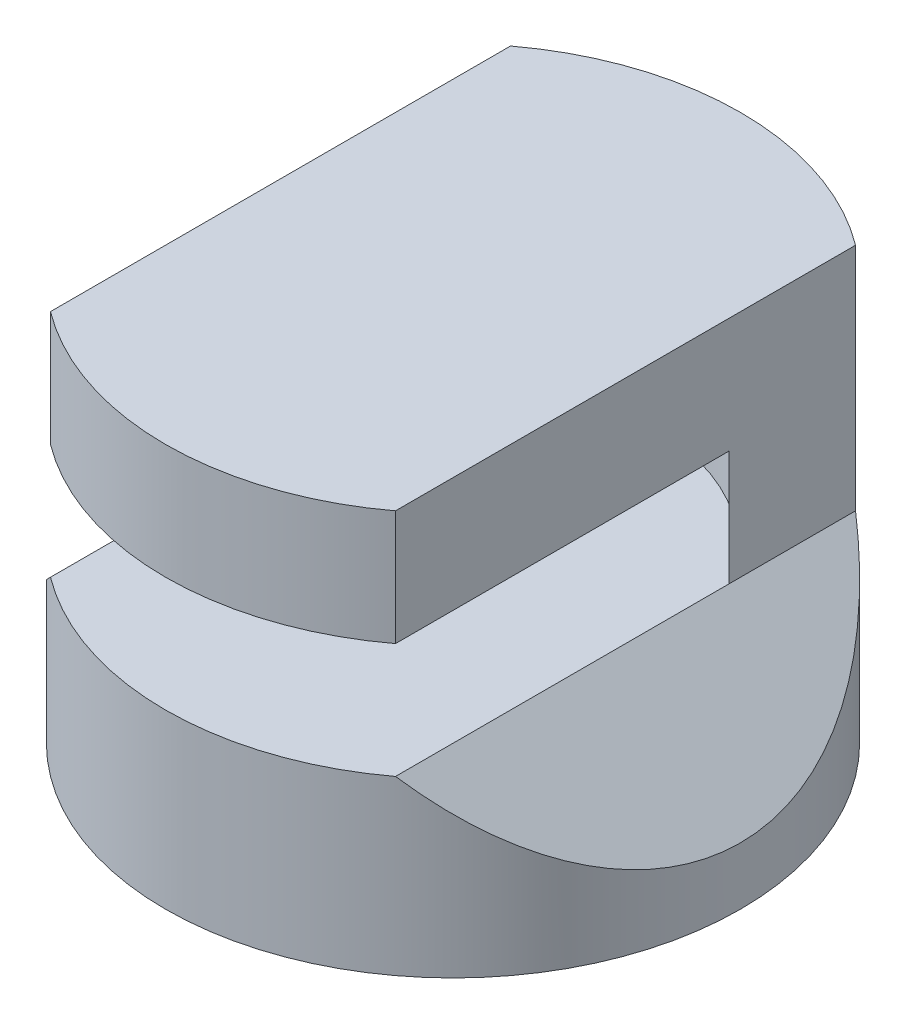
ISO-10303-21;
HEADER;
FILE_DESCRIPTION(('STEP AP214'),'2;1');
FILE_NAME('part.step','',(''),(''),'','','');
FILE_SCHEMA(('AUTOMOTIVE_DESIGN { 1 0 10303 214 1 1 1 1 }'));
ENDSEC;
DATA;
#1=APPLICATION_CONTEXT('core data for automotive mechanical design processes');
#2=APPLICATION_PROTOCOL_DEFINITION('international standard','automotive_design',2000,#1);
#3=PRODUCT_CONTEXT('',#1,'mechanical');
#4=PRODUCT('Part','Part','',(#3));
#5=PRODUCT_RELATED_PRODUCT_CATEGORY('part','',(#4));
#6=PRODUCT_DEFINITION_FORMATION('','',#4);
#7=PRODUCT_DEFINITION_CONTEXT('part definition',#1,'design');
#8=PRODUCT_DEFINITION('design','',#6,#7);
#9=PRODUCT_DEFINITION_SHAPE('','',#8);
#10=(LENGTH_UNIT() NAMED_UNIT(*) SI_UNIT(.MILLI.,.METRE.));
#11=(NAMED_UNIT(*) PLANE_ANGLE_UNIT() SI_UNIT($,.RADIAN.));
#12=(NAMED_UNIT(*) SI_UNIT($,.STERADIAN.) SOLID_ANGLE_UNIT());
#13=UNCERTAINTY_MEASURE_WITH_UNIT(LENGTH_MEASURE(1.E-05),#10,'distance_accuracy_value','');
#14=(GEOMETRIC_REPRESENTATION_CONTEXT(3) GLOBAL_UNCERTAINTY_ASSIGNED_CONTEXT((#13)) GLOBAL_UNIT_ASSIGNED_CONTEXT((#10,
#11,#12)) REPRESENTATION_CONTEXT('',''));
#15=CARTESIAN_POINT('',(0.,0.,0.));
#16=DIRECTION('',(0.,0.,1.));
#17=DIRECTION('',(1.,0.,0.));
#18=AXIS2_PLACEMENT_3D('',#15,#16,#17);
#19=CARTESIAN_POINT('',(20.,80.,100.));
#20=DIRECTION('',(-1.,0.,0.));
#21=DIRECTION('',(0.,-1.,0.));
#22=AXIS2_PLACEMENT_3D('',#19,#20,#21);
#23=PLANE('',#22);
#24=DIRECTION('',(0.,0.,-1.));
#25=VECTOR('',#24,1.);
#26=CARTESIAN_POINT('',(20.,60.,100.));
#27=LINE('',#26,#25);
#28=CARTESIAN_POINT('',(20.,60.,90.));
#29=VERTEX_POINT('',#28);
#30=CARTESIAN_POINT('',(20.,60.,31.97224362268));
#31=VERTEX_POINT('',#30);
#32=EDGE_CURVE('E215',#29,#31,#27,.T.);
#33=ORIENTED_EDGE('',*,*,#32,.F.);
#34=DIRECTION('',(0.,1.,0.));
#35=VECTOR('',#34,1.);
#36=CARTESIAN_POINT('',(20.,-20.,90.));
#37=LINE('',#36,#35);
#38=CARTESIAN_POINT('',(20.,80.,90.));
#39=VERTEX_POINT('',#38);
#40=EDGE_CURVE('E218',#29,#39,#37,.T.);
#41=ORIENTED_EDGE('',*,*,#40,.T.);
#42=DIRECTION('',(0.,0.,-1.));
#43=VECTOR('',#42,1.);
#44=CARTESIAN_POINT('',(20.,80.,100.));
#45=LINE('',#44,#43);
#46=CARTESIAN_POINT('',(20.,80.,9.99999999999999));
#47=VERTEX_POINT('',#46);
#48=EDGE_CURVE('E156',#39,#47,#45,.T.);
#49=ORIENTED_EDGE('',*,*,#48,.T.);
#50=DIRECTION('',(0.,1.,0.));
#51=VECTOR('',#50,1.);
#52=CARTESIAN_POINT('',(20.,-20.,9.99999999999999));
#53=LINE('',#52,#51);
#54=CARTESIAN_POINT('',(20.,40.,9.99999999999998));
#55=VERTEX_POINT('',#54);
#56=EDGE_CURVE('E274',#47,#55,#53,.F.);
#57=ORIENTED_EDGE('',*,*,#56,.T.);
#58=DIRECTION('',(0.,0.,-1.));
#59=VECTOR('',#58,1.);
#60=CARTESIAN_POINT('',(20.,40.,100.));
#61=LINE('',#60,#59);
#62=CARTESIAN_POINT('',(20.,40.,31.97224362268));
#63=VERTEX_POINT('',#62);
#64=EDGE_CURVE('E148',#63,#55,#61,.T.);
#65=ORIENTED_EDGE('',*,*,#64,.F.);
#66=DIRECTION('',(0.,1.,0.));
#67=VECTOR('',#66,1.);
#68=CARTESIAN_POINT('',(20.,40.,31.97224362268));
#69=LINE('',#68,#67);
#70=EDGE_CURVE('E221',#63,#31,#69,.T.);
#71=ORIENTED_EDGE('',*,*,#70,.T.);
#72=EDGE_LOOP('',(#33,#41,#49,#57,#65,#71));
#73=FACE_BOUND('',#72,.T.);
#74=ADVANCED_FACE('F133',(#73),#23,.T.);
#75=CARTESIAN_POINT('',(80.,80.,100.));
#76=DIRECTION('',(1.,0.,0.));
#77=DIRECTION('',(0.,0.,-1.));
#78=AXIS2_PLACEMENT_3D('',#75,#76,#77);
#79=PLANE('',#78);
#80=DIRECTION('',(0.,1.,0.));
#81=VECTOR('',#80,1.);
#82=CARTESIAN_POINT('',(80.,-20.,90.));
#83=LINE('',#82,#81);
#84=CARTESIAN_POINT('',(80.,80.,90.));
#85=VERTEX_POINT('',#84);
#86=CARTESIAN_POINT('',(80.,60.,90.));
#87=VERTEX_POINT('',#86);
#88=EDGE_CURVE('E238',#85,#87,#83,.F.);
#89=ORIENTED_EDGE('',*,*,#88,.T.);
#90=DIRECTION('',(0.,0.,1.));
#91=VECTOR('',#90,1.);
#92=CARTESIAN_POINT('',(80.,60.,100.));
#93=LINE('',#92,#91);
#94=CARTESIAN_POINT('',(80.,60.,31.9722436226801));
#95=VERTEX_POINT('',#94);
#96=EDGE_CURVE('E12',#95,#87,#93,.T.);
#97=ORIENTED_EDGE('',*,*,#96,.F.);
#98=DIRECTION('',(0.,1.,0.));
#99=VECTOR('',#98,1.);
#100=CARTESIAN_POINT('',(80.,40.,31.9722436226801));
#101=LINE('',#100,#99);
#102=CARTESIAN_POINT('',(80.,40.,31.9722436226801));
#103=VERTEX_POINT('',#102);
#104=EDGE_CURVE('E292',#103,#95,#101,.T.);
#105=ORIENTED_EDGE('',*,*,#104,.F.);
#106=DIRECTION('',(0.,0.,-1.));
#107=VECTOR('',#106,1.);
#108=CARTESIAN_POINT('',(80.,40.,100.));
#109=LINE('',#108,#107);
#110=CARTESIAN_POINT('',(80.,40.,10.));
#111=VERTEX_POINT('',#110);
#112=EDGE_CURVE('E256',#103,#111,#109,.T.);
#113=ORIENTED_EDGE('',*,*,#112,.T.);
#114=DIRECTION('',(0.,1.,0.));
#115=VECTOR('',#114,1.);
#116=CARTESIAN_POINT('',(80.,-20.,10.));
#117=LINE('',#116,#115);
#118=CARTESIAN_POINT('',(80.,80.,10.));
#119=VERTEX_POINT('',#118);
#120=EDGE_CURVE('E243',#111,#119,#117,.T.);
#121=ORIENTED_EDGE('',*,*,#120,.T.);
#122=DIRECTION('',(0.,0.,-1.));
#123=VECTOR('',#122,1.);
#124=CARTESIAN_POINT('',(80.,80.,100.));
#125=LINE('',#124,#123);
#126=EDGE_CURVE('E254',#85,#119,#125,.T.);
#127=ORIENTED_EDGE('',*,*,#126,.F.);
#128=EDGE_LOOP('',(#89,#97,#105,#113,#121,#127));
#129=FACE_BOUND('',#128,.T.);
#130=ADVANCED_FACE('F289',(#129),#79,.T.);
#131=CARTESIAN_POINT('',(50.,-20.,50.));
#132=DIRECTION('',(0.,1.,0.));
#133=DIRECTION('',(0.,0.,1.));
#134=AXIS2_PLACEMENT_3D('',#131,#132,#133);
#135=CYLINDRICAL_SURFACE('',#134,50.);
#136=CARTESIAN_POINT('',(50.,10.,50.));
#137=DIRECTION('',(0.,-1.,0.));
#138=DIRECTION('',(0.,0.,-1.));
#139=AXIS2_PLACEMENT_3D('',#136,#137,#138);
#140=CIRCLE('',#139,50.);
#141=CARTESIAN_POINT('',(50.,10.,0.));
#142=VERTEX_POINT('',#141);
#143=EDGE_CURVE('E251',#142,#142,#140,.T.);
#144=ORIENTED_EDGE('',*,*,#143,.F.);
#145=EDGE_LOOP('',(#144));
#146=FACE_BOUND('',#145,.T.);
#147=CARTESIAN_POINT('',(50.,70.,50.));
#148=DIRECTION('',(0.707106781186547,0.707106781186548,0.));
#149=DIRECTION('',(-0.707106781186548,0.707106781186547,0.));
#150=AXIS2_PLACEMENT_3D('',#147,#148,#149);
#151=ELLIPSE('',#150,70.7106781186547,50.);
#152=CARTESIAN_POINT('',(80.,40.,90.));
#153=VERTEX_POINT('',#152);
#154=EDGE_CURVE('E141',#153,#111,#151,.T.);
#155=ORIENTED_EDGE('',*,*,#154,.F.);
#156=CARTESIAN_POINT('',(50.,40.,50.));
#157=DIRECTION('',(0.,1.,0.));
#158=DIRECTION('',(0.,0.,1.));
#159=AXIS2_PLACEMENT_3D('',#156,#157,#158);
#160=CIRCLE('',#159,50.);
#161=CARTESIAN_POINT('',(20.,40.,90.));
#162=VERTEX_POINT('',#161);
#163=EDGE_CURVE('E232',#153,#162,#160,.F.);
#164=ORIENTED_EDGE('',*,*,#163,.T.);
#165=CARTESIAN_POINT('',(50.,70.,50.));
#166=DIRECTION('',(-0.707106781186547,0.707106781186548,0.));
#167=DIRECTION('',(0.707106781186548,0.707106781186547,0.));
#168=AXIS2_PLACEMENT_3D('',#165,#166,#167);
#169=ELLIPSE('',#168,70.7106781186547,50.);
#170=EDGE_CURVE('E249',#55,#162,#169,.T.);
#171=ORIENTED_EDGE('',*,*,#170,.F.);
#172=ORIENTED_EDGE('',*,*,#56,.F.);
#173=CARTESIAN_POINT('',(50.,80.,50.));
#174=DIRECTION('',(0.,1.,0.));
#175=DIRECTION('',(0.,0.,1.));
#176=AXIS2_PLACEMENT_3D('',#173,#174,#175);
#177=CIRCLE('',#176,50.);
#178=EDGE_CURVE('E246',#119,#47,#177,.T.);
#179=ORIENTED_EDGE('',*,*,#178,.F.);
#180=ORIENTED_EDGE('',*,*,#120,.F.);
#181=EDGE_LOOP('',(#155,#164,#171,#172,#179,#180));
#182=FACE_BOUND('',#181,.T.);
#183=ADVANCED_FACE('F285',(#146,#182),#135,.T.);
#184=ORIENTED_EDGE('',*,*,#40,.F.);
#185=CARTESIAN_POINT('',(50.,60.,50.));
#186=DIRECTION('',(0.,-1.,0.));
#187=DIRECTION('',(0.,0.,-1.));
#188=AXIS2_PLACEMENT_3D('',#185,#186,#187);
#189=CIRCLE('',#188,50.);
#190=EDGE_CURVE('E227',#29,#87,#189,.F.);
#191=ORIENTED_EDGE('',*,*,#190,.T.);
#192=ORIENTED_EDGE('',*,*,#88,.F.);
#193=CARTESIAN_POINT('',(50.,80.,50.));
#194=DIRECTION('',(0.,1.,0.));
#195=DIRECTION('',(0.,0.,1.));
#196=AXIS2_PLACEMENT_3D('',#193,#194,#195);
#197=CIRCLE('',#196,50.);
#198=EDGE_CURVE('E236',#39,#85,#197,.T.);
#199=ORIENTED_EDGE('',*,*,#198,.F.);
#200=EDGE_LOOP('',(#184,#191,#192,#199));
#201=FACE_BOUND('',#200,.T.);
#202=ADVANCED_FACE('F234',(#201),#135,.T.);
#203=CARTESIAN_POINT('',(0.,0.,100.));
#204=DIRECTION('',(0.,1.,0.));
#205=DIRECTION('',(0.,0.,1.));
#206=AXIS2_PLACEMENT_3D('',#203,#204,#205);
#207=PLANE('',#206);
#208=DIRECTION('',(0.,0.,-1.));
#209=VECTOR('',#208,1.);
#210=CARTESIAN_POINT('',(20.,0.,100.));
#211=LINE('',#210,#209);
#212=CARTESIAN_POINT('',(20.,0.,68.02775637732));
#213=VERTEX_POINT('',#212);
#214=CARTESIAN_POINT('',(20.,0.,31.97224362268));
#215=VERTEX_POINT('',#214);
#216=EDGE_CURVE('E271',#213,#215,#211,.T.);
#217=ORIENTED_EDGE('',*,*,#216,.T.);
#218=CARTESIAN_POINT('',(50.,0.,50.));
#219=DIRECTION('',(0.,-1.,0.));
#220=DIRECTION('',(0.,0.,-1.));
#221=AXIS2_PLACEMENT_3D('',#218,#219,#220);
#222=CIRCLE('',#221,35.);
#223=CARTESIAN_POINT('',(80.,0.,31.9722436226801));
#224=VERTEX_POINT('',#223);
#225=EDGE_CURVE('E309',#215,#224,#222,.T.);
#226=ORIENTED_EDGE('',*,*,#225,.T.);
#227=DIRECTION('',(0.,0.,-1.));
#228=VECTOR('',#227,1.);
#229=CARTESIAN_POINT('',(80.,0.,100.));
#230=LINE('',#229,#228);
#231=CARTESIAN_POINT('',(80.,0.,68.0277563773199));
#232=VERTEX_POINT('',#231);
#233=EDGE_CURVE('E262',#232,#224,#230,.T.);
#234=ORIENTED_EDGE('',*,*,#233,.F.);
#235=CARTESIAN_POINT('',(50.,0.,50.));
#236=DIRECTION('',(0.,-1.,0.));
#237=DIRECTION('',(0.,0.,-1.));
#238=AXIS2_PLACEMENT_3D('',#235,#236,#237);
#239=CIRCLE('',#238,35.);
#240=EDGE_CURVE('E321',#232,#213,#239,.T.);
#241=ORIENTED_EDGE('',*,*,#240,.T.);
#242=EDGE_LOOP('',(#217,#226,#234,#241));
#243=FACE_BOUND('',#242,.T.);
#244=ADVANCED_FACE('F135',(#243),#207,.F.);
#245=CARTESIAN_POINT('',(20.,0.,100.));
#246=DIRECTION('',(-1.,0.,0.));
#247=DIRECTION('',(0.,0.,1.));
#248=AXIS2_PLACEMENT_3D('',#245,#246,#247);
#249=PLANE('',#248);
#250=DIRECTION('',(0.,0.,-1.));
#251=VECTOR('',#250,1.);
#252=CARTESIAN_POINT('',(20.,10.,100.));
#253=LINE('',#252,#251);
#254=CARTESIAN_POINT('',(20.,10.,68.02775637732));
#255=VERTEX_POINT('',#254);
#256=CARTESIAN_POINT('',(20.,10.,31.97224362268));
#257=VERTEX_POINT('',#256);
#258=EDGE_CURVE('E268',#255,#257,#253,.T.);
#259=ORIENTED_EDGE('',*,*,#258,.T.);
#260=DIRECTION('',(0.,-1.,0.));
#261=VECTOR('',#260,1.);
#262=CARTESIAN_POINT('',(20.,10.,31.97224362268));
#263=LINE('',#262,#261);
#264=EDGE_CURVE('E306',#257,#215,#263,.T.);
#265=ORIENTED_EDGE('',*,*,#264,.T.);
#266=ORIENTED_EDGE('',*,*,#216,.F.);
#267=DIRECTION('',(0.,-1.,0.));
#268=VECTOR('',#267,1.);
#269=CARTESIAN_POINT('',(20.,10.,68.02775637732));
#270=LINE('',#269,#268);
#271=EDGE_CURVE('E295',#255,#213,#270,.T.);
#272=ORIENTED_EDGE('',*,*,#271,.F.);
#273=EDGE_LOOP('',(#259,#265,#266,#272));
#274=FACE_BOUND('',#273,.T.);
#275=ADVANCED_FACE('F330',(#274),#249,.T.);
#276=CARTESIAN_POINT('',(80.,0.,100.));
#277=DIRECTION('',(1.,0.,0.));
#278=DIRECTION('',(0.,0.,-1.));
#279=AXIS2_PLACEMENT_3D('',#276,#277,#278);
#280=PLANE('',#279);
#281=ORIENTED_EDGE('',*,*,#233,.T.);
#282=DIRECTION('',(0.,-1.,0.));
#283=VECTOR('',#282,1.);
#284=CARTESIAN_POINT('',(80.,10.,31.9722436226801));
#285=LINE('',#284,#283);
#286=CARTESIAN_POINT('',(80.,10.,31.9722436226801));
#287=VERTEX_POINT('',#286);
#288=EDGE_CURVE('E314',#287,#224,#285,.T.);
#289=ORIENTED_EDGE('',*,*,#288,.F.);
#290=DIRECTION('',(0.,0.,-1.));
#291=VECTOR('',#290,1.);
#292=CARTESIAN_POINT('',(80.,10.,100.));
#293=LINE('',#292,#291);
#294=CARTESIAN_POINT('',(80.,10.,68.0277563773199));
#295=VERTEX_POINT('',#294);
#296=EDGE_CURVE('E265',#295,#287,#293,.T.);
#297=ORIENTED_EDGE('',*,*,#296,.F.);
#298=DIRECTION('',(0.,-1.,0.));
#299=VECTOR('',#298,1.);
#300=CARTESIAN_POINT('',(80.,10.,68.0277563773199));
#301=LINE('',#300,#299);
#302=EDGE_CURVE('E318',#295,#232,#301,.T.);
#303=ORIENTED_EDGE('',*,*,#302,.T.);
#304=EDGE_LOOP('',(#281,#289,#297,#303));
#305=FACE_BOUND('',#304,.T.);
#306=ADVANCED_FACE('F337',(#305),#280,.T.);
#307=CARTESIAN_POINT('',(0.,60.,0.));
#308=DIRECTION('',(0.,1.,0.));
#309=DIRECTION('',(0.,0.,1.));
#310=AXIS2_PLACEMENT_3D('',#307,#308,#309);
#311=PLANE('',#310);
#312=ORIENTED_EDGE('',*,*,#32,.T.);
#313=CARTESIAN_POINT('',(50.,60.,50.));
#314=DIRECTION('',(0.,1.,0.));
#315=DIRECTION('',(0.,0.,1.));
#316=AXIS2_PLACEMENT_3D('',#313,#314,#315);
#317=CIRCLE('',#316,35.);
#318=EDGE_CURVE('E224',#95,#31,#317,.T.);
#319=ORIENTED_EDGE('',*,*,#318,.F.);
#320=ORIENTED_EDGE('',*,*,#96,.T.);
#321=ORIENTED_EDGE('',*,*,#190,.F.);
#322=EDGE_LOOP('',(#312,#319,#320,#321));
#323=FACE_BOUND('',#322,.T.);
#324=ADVANCED_FACE('F228',(#323),#311,.F.);
#325=CARTESIAN_POINT('',(0.,40.,0.));
#326=DIRECTION('',(0.,1.,0.));
#327=DIRECTION('',(0.,0.,1.));
#328=AXIS2_PLACEMENT_3D('',#325,#326,#327);
#329=PLANE('',#328);
#330=EDGE_CURVE('E257',#153,#103,#109,.T.);
#331=ORIENTED_EDGE('',*,*,#330,.T.);
#332=CARTESIAN_POINT('',(50.,40.,50.));
#333=DIRECTION('',(0.,1.,0.));
#334=DIRECTION('',(0.,0.,1.));
#335=AXIS2_PLACEMENT_3D('',#332,#333,#334);
#336=CIRCLE('',#335,35.);
#337=EDGE_CURVE('E294',#103,#63,#336,.T.);
#338=ORIENTED_EDGE('',*,*,#337,.T.);
#339=EDGE_CURVE('E260',#162,#63,#61,.T.);
#340=ORIENTED_EDGE('',*,*,#339,.F.);
#341=ORIENTED_EDGE('',*,*,#163,.F.);
#342=EDGE_LOOP('',(#331,#338,#340,#341));
#343=FACE_BOUND('',#342,.T.);
#344=ADVANCED_FACE('F305',(#343),#329,.T.);
#345=CARTESIAN_POINT('',(0.,80.,100.));
#346=DIRECTION('',(0.,-1.,0.));
#347=DIRECTION('',(0.,0.,-1.));
#348=AXIS2_PLACEMENT_3D('',#345,#346,#347);
#349=PLANE('',#348);
#350=ORIENTED_EDGE('',*,*,#126,.T.);
#351=ORIENTED_EDGE('',*,*,#178,.T.);
#352=ORIENTED_EDGE('',*,*,#48,.F.);
#353=ORIENTED_EDGE('',*,*,#198,.T.);
#354=EDGE_LOOP('',(#350,#351,#352,#353));
#355=FACE_BOUND('',#354,.T.);
#356=ADVANCED_FACE('F364',(#355),#349,.F.);
#357=CARTESIAN_POINT('',(20.,40.,100.));
#358=DIRECTION('',(-0.707106781186547,0.707106781186548,0.));
#359=DIRECTION('',(-0.707106781186548,-0.707106781186547,0.));
#360=AXIS2_PLACEMENT_3D('',#357,#358,#359);
#361=PLANE('',#360);
#362=ORIENTED_EDGE('',*,*,#170,.T.);
#363=ORIENTED_EDGE('',*,*,#339,.T.);
#364=ORIENTED_EDGE('',*,*,#64,.T.);
#365=EDGE_LOOP('',(#362,#363,#364));
#366=FACE_BOUND('',#365,.T.);
#367=ADVANCED_FACE('F344',(#366),#361,.T.);
#368=CARTESIAN_POINT('',(100.,10.,100.));
#369=DIRECTION('',(0.,-1.,0.));
#370=DIRECTION('',(1.,0.,0.));
#371=AXIS2_PLACEMENT_3D('',#368,#369,#370);
#372=PLANE('',#371);
#373=CARTESIAN_POINT('',(50.,10.,50.));
#374=DIRECTION('',(0.,-1.,0.));
#375=DIRECTION('',(0.,0.,-1.));
#376=AXIS2_PLACEMENT_3D('',#373,#374,#375);
#377=CIRCLE('',#376,35.);
#378=EDGE_CURVE('E312',#257,#287,#377,.T.);
#379=ORIENTED_EDGE('',*,*,#378,.F.);
#380=ORIENTED_EDGE('',*,*,#258,.F.);
#381=CARTESIAN_POINT('',(50.,10.,50.));
#382=DIRECTION('',(0.,-1.,0.));
#383=DIRECTION('',(0.,0.,-1.));
#384=AXIS2_PLACEMENT_3D('',#381,#382,#383);
#385=CIRCLE('',#384,35.);
#386=EDGE_CURVE('E299',#295,#255,#385,.T.);
#387=ORIENTED_EDGE('',*,*,#386,.F.);
#388=ORIENTED_EDGE('',*,*,#296,.T.);
#389=EDGE_LOOP('',(#379,#380,#387,#388));
#390=FACE_BOUND('',#389,.T.);
#391=ORIENTED_EDGE('',*,*,#143,.T.);
#392=EDGE_LOOP('',(#391));
#393=FACE_BOUND('',#392,.T.);
#394=ADVANCED_FACE('F341',(#390,#393),#372,.T.);
#395=CARTESIAN_POINT('',(80.,40.,100.));
#396=DIRECTION('',(0.707106781186547,0.707106781186548,0.));
#397=DIRECTION('',(-0.707106781186548,0.707106781186547,0.));
#398=AXIS2_PLACEMENT_3D('',#395,#396,#397);
#399=PLANE('',#398);
#400=ORIENTED_EDGE('',*,*,#330,.F.);
#401=ORIENTED_EDGE('',*,*,#154,.T.);
#402=ORIENTED_EDGE('',*,*,#112,.F.);
#403=EDGE_LOOP('',(#400,#401,#402));
#404=FACE_BOUND('',#403,.T.);
#405=ADVANCED_FACE('F280',(#404),#399,.T.);
#406=CARTESIAN_POINT('',(50.,40.,50.));
#407=DIRECTION('',(0.,1.,0.));
#408=DIRECTION('',(0.,0.,1.));
#409=AXIS2_PLACEMENT_3D('',#406,#407,#408);
#410=CYLINDRICAL_SURFACE('',#409,35.);
#411=ORIENTED_EDGE('',*,*,#337,.F.);
#412=ORIENTED_EDGE('',*,*,#104,.T.);
#413=ORIENTED_EDGE('',*,*,#318,.T.);
#414=ORIENTED_EDGE('',*,*,#70,.F.);
#415=EDGE_LOOP('',(#411,#412,#413,#414));
#416=FACE_BOUND('',#415,.T.);
#417=ADVANCED_FACE('F303',(#416),#410,.F.);
#418=CARTESIAN_POINT('',(50.,10.,50.));
#419=DIRECTION('',(0.,-1.,0.));
#420=DIRECTION('',(0.,0.,-1.));
#421=AXIS2_PLACEMENT_3D('',#418,#419,#420);
#422=CYLINDRICAL_SURFACE('',#421,35.);
#423=ORIENTED_EDGE('',*,*,#240,.F.);
#424=ORIENTED_EDGE('',*,*,#302,.F.);
#425=ORIENTED_EDGE('',*,*,#386,.T.);
#426=ORIENTED_EDGE('',*,*,#271,.T.);
#427=EDGE_LOOP('',(#423,#424,#425,#426));
#428=FACE_BOUND('',#427,.T.);
#429=ADVANCED_FACE('F339',(#428),#422,.T.);
#430=CARTESIAN_POINT('',(50.,10.,50.));
#431=DIRECTION('',(0.,-1.,0.));
#432=DIRECTION('',(0.,0.,-1.));
#433=AXIS2_PLACEMENT_3D('',#430,#431,#432);
#434=CYLINDRICAL_SURFACE('',#433,35.);
#435=ORIENTED_EDGE('',*,*,#225,.F.);
#436=ORIENTED_EDGE('',*,*,#264,.F.);
#437=ORIENTED_EDGE('',*,*,#378,.T.);
#438=ORIENTED_EDGE('',*,*,#288,.T.);
#439=EDGE_LOOP('',(#435,#436,#437,#438));
#440=FACE_BOUND('',#439,.T.);
#441=ADVANCED_FACE('F334',(#440),#434,.T.);
#442=CLOSED_SHELL('',(#74,#130,#183,#202,#244,#275,#306,#324,#344,#356,#367,#394,#405,#417,#429,#441));
#443=MANIFOLD_SOLID_BREP('B2',#442);
#444=ADVANCED_BREP_SHAPE_REPRESENTATION('',(#18,#443),#14);
#445=SHAPE_DEFINITION_REPRESENTATION(#9,#444);
ENDSEC;
END-ISO-10303-21;
